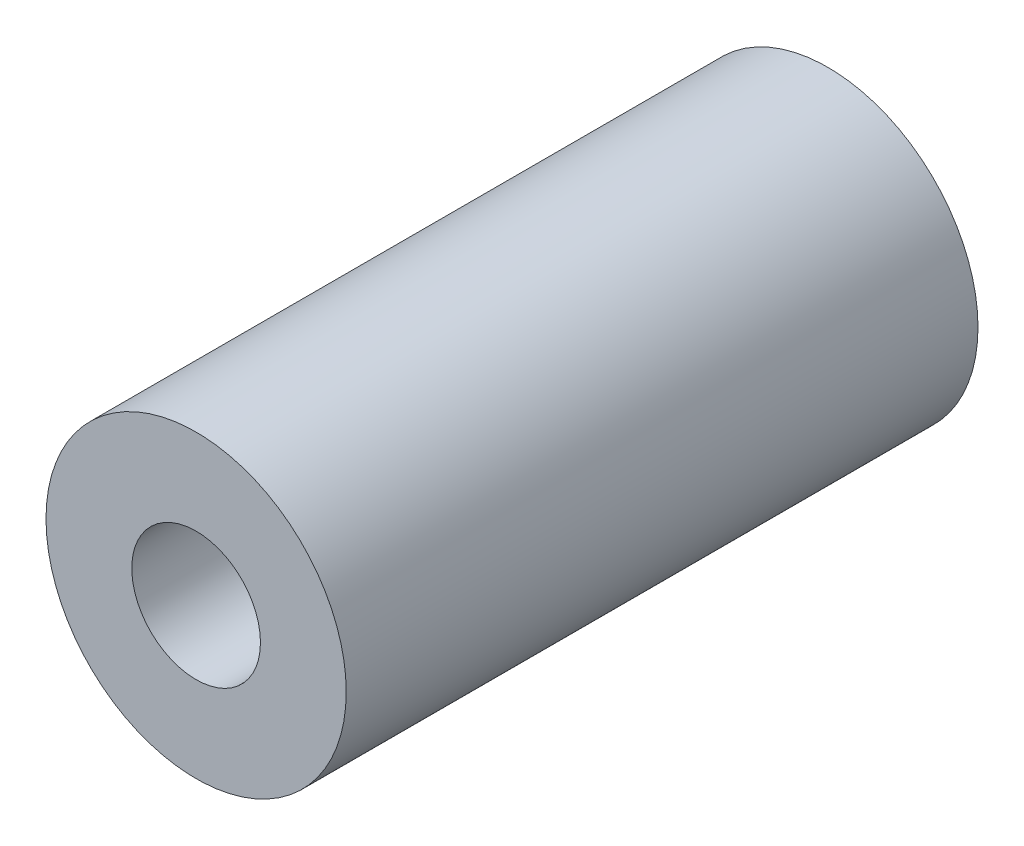
ISO-10303-21;
HEADER;
FILE_DESCRIPTION(('STEP AP214'),'2;1');
FILE_NAME('part.step','',(''),(''),'','','');
FILE_SCHEMA(('AUTOMOTIVE_DESIGN { 1 0 10303 214 1 1 1 1 }'));
ENDSEC;
DATA;
#1=APPLICATION_CONTEXT('core data for automotive mechanical design processes');
#2=APPLICATION_PROTOCOL_DEFINITION('international standard','automotive_design',2000,#1);
#3=PRODUCT_CONTEXT('',#1,'mechanical');
#4=PRODUCT('Part','Part','',(#3));
#5=PRODUCT_RELATED_PRODUCT_CATEGORY('part','',(#4));
#6=PRODUCT_DEFINITION_FORMATION('','',#4);
#7=PRODUCT_DEFINITION_CONTEXT('part definition',#1,'design');
#8=PRODUCT_DEFINITION('design','',#6,#7);
#9=PRODUCT_DEFINITION_SHAPE('','',#8);
#10=(LENGTH_UNIT() NAMED_UNIT(*) SI_UNIT(.MILLI.,.METRE.));
#11=(NAMED_UNIT(*) PLANE_ANGLE_UNIT() SI_UNIT($,.RADIAN.));
#12=(NAMED_UNIT(*) SI_UNIT($,.STERADIAN.) SOLID_ANGLE_UNIT());
#13=UNCERTAINTY_MEASURE_WITH_UNIT(LENGTH_MEASURE(1.E-05),#10,'distance_accuracy_value','');
#14=(GEOMETRIC_REPRESENTATION_CONTEXT(3) GLOBAL_UNCERTAINTY_ASSIGNED_CONTEXT((#13)) GLOBAL_UNIT_ASSIGNED_CONTEXT((#10,
#11,#12)) REPRESENTATION_CONTEXT('',''));
#15=CARTESIAN_POINT('',(0.,0.,0.));
#16=DIRECTION('',(0.,0.,1.));
#17=DIRECTION('',(1.,0.,0.));
#18=AXIS2_PLACEMENT_3D('',#15,#16,#17);
#19=CARTESIAN_POINT('',(0.,3.5,0.));
#20=DIRECTION('',(0.,0.,-1.));
#21=DIRECTION('',(-1.,0.,0.));
#22=AXIS2_PLACEMENT_3D('',#19,#20,#21);
#23=PLANE('',#22);
#24=CARTESIAN_POINT('',(0.,0.,0.));
#25=DIRECTION('',(0.,0.,1.));
#26=DIRECTION('',(1.,0.,0.));
#27=AXIS2_PLACEMENT_3D('',#24,#25,#26);
#28=CIRCLE('',#27,1.5);
#29=CARTESIAN_POINT('',(1.5,0.,0.));
#30=VERTEX_POINT('',#29);
#31=EDGE_CURVE('E10',#30,#30,#28,.T.);
#32=ORIENTED_EDGE('',*,*,#31,.F.);
#33=EDGE_LOOP('',(#32));
#34=FACE_BOUND('',#33,.T.);
#35=CARTESIAN_POINT('',(0.,0.,0.));
#36=DIRECTION('',(0.,0.,1.));
#37=DIRECTION('',(1.,0.,0.));
#38=AXIS2_PLACEMENT_3D('',#35,#36,#37);
#39=CIRCLE('',#38,3.5);
#40=CARTESIAN_POINT('',(3.5,0.,0.));
#41=VERTEX_POINT('',#40);
#42=EDGE_CURVE('E45',#41,#41,#39,.T.);
#43=ORIENTED_EDGE('',*,*,#42,.T.);
#44=EDGE_LOOP('',(#43));
#45=FACE_BOUND('',#44,.T.);
#46=ADVANCED_FACE('F31',(#34,#45),#23,.F.);
#47=CARTESIAN_POINT('',(0.,0.,0.));
#48=DIRECTION('',(0.,0.,1.));
#49=DIRECTION('',(1.,0.,0.));
#50=AXIS2_PLACEMENT_3D('',#47,#48,#49);
#51=CYLINDRICAL_SURFACE('',#50,1.5);
#52=CARTESIAN_POINT('',(0.,0.,-14.73));
#53=DIRECTION('',(0.,0.,1.));
#54=DIRECTION('',(1.,0.,0.));
#55=AXIS2_PLACEMENT_3D('',#52,#53,#54);
#56=CIRCLE('',#55,1.5);
#57=CARTESIAN_POINT('',(1.5,0.,-14.73));
#58=VERTEX_POINT('',#57);
#59=EDGE_CURVE('E37',#58,#58,#56,.T.);
#60=ORIENTED_EDGE('',*,*,#59,.F.);
#61=EDGE_LOOP('',(#60));
#62=FACE_BOUND('',#61,.T.);
#63=ORIENTED_EDGE('',*,*,#31,.T.);
#64=EDGE_LOOP('',(#63));
#65=FACE_BOUND('',#64,.T.);
#66=ADVANCED_FACE('F60',(#62,#65),#51,.F.);
#67=CARTESIAN_POINT('',(0.,3.5,-14.73));
#68=DIRECTION('',(0.,0.,1.));
#69=DIRECTION('',(1.,0.,0.));
#70=AXIS2_PLACEMENT_3D('',#67,#68,#69);
#71=PLANE('',#70);
#72=CARTESIAN_POINT('',(0.,0.,-14.73));
#73=DIRECTION('',(0.,0.,1.));
#74=DIRECTION('',(1.,0.,0.));
#75=AXIS2_PLACEMENT_3D('',#72,#73,#74);
#76=CIRCLE('',#75,3.5);
#77=CARTESIAN_POINT('',(3.5,0.,-14.73));
#78=VERTEX_POINT('',#77);
#79=EDGE_CURVE('E41',#78,#78,#76,.T.);
#80=ORIENTED_EDGE('',*,*,#79,.F.);
#81=EDGE_LOOP('',(#80));
#82=FACE_BOUND('',#81,.T.);
#83=ORIENTED_EDGE('',*,*,#59,.T.);
#84=EDGE_LOOP('',(#83));
#85=FACE_BOUND('',#84,.T.);
#86=ADVANCED_FACE('F55',(#82,#85),#71,.F.);
#87=CARTESIAN_POINT('',(0.,0.,0.));
#88=DIRECTION('',(0.,0.,1.));
#89=DIRECTION('',(1.,0.,0.));
#90=AXIS2_PLACEMENT_3D('',#87,#88,#89);
#91=CYLINDRICAL_SURFACE('',#90,3.5);
#92=ORIENTED_EDGE('',*,*,#42,.F.);
#93=EDGE_LOOP('',(#92));
#94=FACE_BOUND('',#93,.T.);
#95=ORIENTED_EDGE('',*,*,#79,.T.);
#96=EDGE_LOOP('',(#95));
#97=FACE_BOUND('',#96,.T.);
#98=ADVANCED_FACE('F52',(#94,#97),#91,.T.);
#99=CLOSED_SHELL('',(#46,#66,#86,#98));
#100=MANIFOLD_SOLID_BREP('B2',#99);
#101=ADVANCED_BREP_SHAPE_REPRESENTATION('',(#18,#100),#14);
#102=SHAPE_DEFINITION_REPRESENTATION(#9,#101);
ENDSEC;
END-ISO-10303-21;
